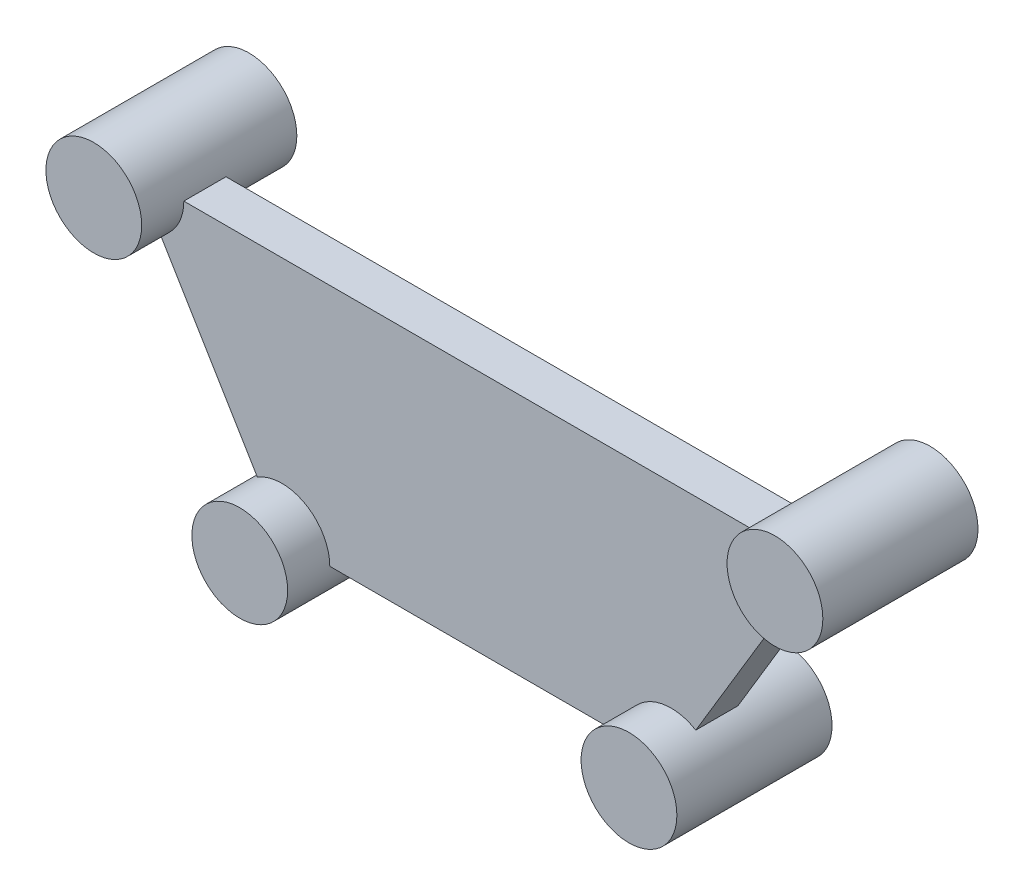
ISO-10303-21;
HEADER;
FILE_DESCRIPTION(('STEP AP214'),'2;1');
FILE_NAME('part.step','',(''),(''),'','','');
FILE_SCHEMA(('AUTOMOTIVE_DESIGN { 1 0 10303 214 1 1 1 1 }'));
ENDSEC;
DATA;
#1=APPLICATION_CONTEXT('core data for automotive mechanical design processes');
#2=APPLICATION_PROTOCOL_DEFINITION('international standard','automotive_design',2000,#1);
#3=PRODUCT_CONTEXT('',#1,'mechanical');
#4=PRODUCT('Part','Part','',(#3));
#5=PRODUCT_RELATED_PRODUCT_CATEGORY('part','',(#4));
#6=PRODUCT_DEFINITION_FORMATION('','',#4);
#7=PRODUCT_DEFINITION_CONTEXT('part definition',#1,'design');
#8=PRODUCT_DEFINITION('design','',#6,#7);
#9=PRODUCT_DEFINITION_SHAPE('','',#8);
#10=(LENGTH_UNIT() NAMED_UNIT(*) SI_UNIT(.MILLI.,.METRE.));
#11=(NAMED_UNIT(*) PLANE_ANGLE_UNIT() SI_UNIT($,.RADIAN.));
#12=(NAMED_UNIT(*) SI_UNIT($,.STERADIAN.) SOLID_ANGLE_UNIT());
#13=UNCERTAINTY_MEASURE_WITH_UNIT(LENGTH_MEASURE(1.E-05),#10,'distance_accuracy_value','');
#14=(GEOMETRIC_REPRESENTATION_CONTEXT(3) GLOBAL_UNCERTAINTY_ASSIGNED_CONTEXT((#13)) GLOBAL_UNIT_ASSIGNED_CONTEXT((#10,
#11,#12)) REPRESENTATION_CONTEXT('',''));
#15=CARTESIAN_POINT('',(0.,0.,0.));
#16=DIRECTION('',(0.,0.,1.));
#17=DIRECTION('',(1.,0.,0.));
#18=AXIS2_PLACEMENT_3D('',#15,#16,#17);
#19=CARTESIAN_POINT('',(101.6,-48.9376038944925,22.));
#20=DIRECTION('',(0.,-1.,0.));
#21=DIRECTION('',(0.,0.,-1.));
#22=AXIS2_PLACEMENT_3D('',#19,#20,#21);
#23=PLANE('',#22);
#24=DIRECTION('',(0.,0.,1.));
#25=VECTOR('',#24,1.);
#26=CARTESIAN_POINT('',(-76.6,-48.9376038944925,-37.));
#27=LINE('',#26,#25);
#28=CARTESIAN_POINT('',(-76.6,-48.9376038944925,0.));
#29=VERTEX_POINT('',#28);
#30=CARTESIAN_POINT('',(-76.6,-48.9376038944925,22.));
#31=VERTEX_POINT('',#30);
#32=EDGE_CURVE('E139',#29,#31,#27,.T.);
#33=ORIENTED_EDGE('',*,*,#32,.F.);
#34=DIRECTION('',(-1.,0.,0.));
#35=VECTOR('',#34,1.);
#36=CARTESIAN_POINT('',(101.6,-48.9376038944925,0.));
#37=LINE('',#36,#35);
#38=CARTESIAN_POINT('',(76.6,-48.9376038944925,0.));
#39=VERTEX_POINT('',#38);
#40=EDGE_CURVE('E111',#39,#29,#37,.T.);
#41=ORIENTED_EDGE('',*,*,#40,.F.);
#42=DIRECTION('',(0.,0.,1.));
#43=VECTOR('',#42,1.);
#44=CARTESIAN_POINT('',(76.5999999999999,-48.9376038944925,-37.));
#45=LINE('',#44,#43);
#46=CARTESIAN_POINT('',(76.6,-48.9376038944925,22.));
#47=VERTEX_POINT('',#46);
#48=EDGE_CURVE('E158',#47,#39,#45,.F.);
#49=ORIENTED_EDGE('',*,*,#48,.F.);
#50=DIRECTION('',(-1.,0.,0.));
#51=VECTOR('',#50,1.);
#52=CARTESIAN_POINT('',(101.6,-48.9376038944925,22.));
#53=LINE('',#52,#51);
#54=EDGE_CURVE('E185',#47,#31,#53,.T.);
#55=ORIENTED_EDGE('',*,*,#54,.T.);
#56=EDGE_LOOP('',(#33,#41,#49,#55));
#57=FACE_BOUND('',#56,.T.);
#58=ADVANCED_FACE('F37',(#57),#23,.T.);
#59=CARTESIAN_POINT('',(101.6,-48.9376038944925,22.));
#60=DIRECTION('',(-0.857492925712544,0.514495755427527,0.));
#61=DIRECTION('',(-0.514495755427527,-0.857492925712544,0.));
#62=AXIS2_PLACEMENT_3D('',#59,#60,#61);
#63=PLANE('',#62);
#64=DIRECTION('',(0.514495755427527,0.857492925712544,0.));
#65=VECTOR('',#64,1.);
#66=CARTESIAN_POINT('',(101.6,-48.9376038944925,22.));
#67=LINE('',#66,#65);
#68=CARTESIAN_POINT('',(114.462393885688,-27.5002807516789,22.));
#69=VERTEX_POINT('',#68);
#70=CARTESIAN_POINT('',(164.937606114312,56.6250729626939,22.));
#71=VERTEX_POINT('',#70);
#72=EDGE_CURVE('E195',#69,#71,#67,.T.);
#73=ORIENTED_EDGE('',*,*,#72,.F.);
#74=DIRECTION('',(0.,0.,1.));
#75=VECTOR('',#74,1.);
#76=CARTESIAN_POINT('',(114.462393885688,-27.5002807516789,-37.));
#77=LINE('',#76,#75);
#78=CARTESIAN_POINT('',(114.462393885688,-27.5002807516789,0.));
#79=VERTEX_POINT('',#78);
#80=EDGE_CURVE('E154',#69,#79,#77,.F.);
#81=ORIENTED_EDGE('',*,*,#80,.T.);
#82=DIRECTION('',(0.514495755427527,0.857492925712544,0.));
#83=VECTOR('',#82,1.);
#84=CARTESIAN_POINT('',(101.6,-48.9376038944925,0.));
#85=LINE('',#84,#83);
#86=CARTESIAN_POINT('',(164.937606114312,56.6250729626939,0.));
#87=VERTEX_POINT('',#86);
#88=EDGE_CURVE('E189',#79,#87,#85,.T.);
#89=ORIENTED_EDGE('',*,*,#88,.T.);
#90=DIRECTION('',(0.,0.,1.));
#91=VECTOR('',#90,1.);
#92=CARTESIAN_POINT('',(164.937606114312,56.6250729626939,-37.));
#93=LINE('',#92,#91);
#94=EDGE_CURVE('E177',#87,#71,#93,.T.);
#95=ORIENTED_EDGE('',*,*,#94,.T.);
#96=EDGE_LOOP('',(#73,#81,#89,#95));
#97=FACE_BOUND('',#96,.T.);
#98=ADVANCED_FACE('F226',(#97),#63,.F.);
#99=CARTESIAN_POINT('',(-177.8,78.0623961055075,22.));
#100=DIRECTION('',(0.,1.,0.));
#101=DIRECTION('',(0.,0.,1.));
#102=AXIS2_PLACEMENT_3D('',#99,#100,#101);
#103=PLANE('',#102);
#104=DIRECTION('',(0.,0.,1.));
#105=VECTOR('',#104,1.);
#106=CARTESIAN_POINT('',(-152.8,78.0623961055075,-37.));
#107=LINE('',#106,#105);
#108=CARTESIAN_POINT('',(-152.8,78.0623961055075,22.));
#109=VERTEX_POINT('',#108);
#110=CARTESIAN_POINT('',(-152.8,78.0623961055075,0.));
#111=VERTEX_POINT('',#110);
#112=EDGE_CURVE('E52',#109,#111,#107,.F.);
#113=ORIENTED_EDGE('',*,*,#112,.F.);
#114=DIRECTION('',(1.,0.,0.));
#115=VECTOR('',#114,1.);
#116=CARTESIAN_POINT('',(-177.8,78.0623961055075,22.));
#117=LINE('',#116,#115);
#118=CARTESIAN_POINT('',(152.8,78.0623961055075,22.));
#119=VERTEX_POINT('',#118);
#120=EDGE_CURVE('E192',#109,#119,#117,.T.);
#121=ORIENTED_EDGE('',*,*,#120,.T.);
#122=DIRECTION('',(0.,0.,1.));
#123=VECTOR('',#122,1.);
#124=CARTESIAN_POINT('',(152.8,78.0623961055075,-37.));
#125=LINE('',#124,#123);
#126=CARTESIAN_POINT('',(152.8,78.0623961055075,0.));
#127=VERTEX_POINT('',#126);
#128=EDGE_CURVE('E173',#127,#119,#125,.T.);
#129=ORIENTED_EDGE('',*,*,#128,.F.);
#130=DIRECTION('',(1.,0.,0.));
#131=VECTOR('',#130,1.);
#132=CARTESIAN_POINT('',(-177.8,78.0623961055075,0.));
#133=LINE('',#132,#131);
#134=EDGE_CURVE('E110',#111,#127,#133,.T.);
#135=ORIENTED_EDGE('',*,*,#134,.F.);
#136=EDGE_LOOP('',(#113,#121,#129,#135));
#137=FACE_BOUND('',#136,.T.);
#138=ADVANCED_FACE('F233',(#137),#103,.T.);
#139=CARTESIAN_POINT('',(-101.6,-48.9376038944925,22.));
#140=DIRECTION('',(-0.857492925712544,-0.514495755427527,0.));
#141=DIRECTION('',(0.514495755427527,-0.857492925712544,0.));
#142=AXIS2_PLACEMENT_3D('',#139,#140,#141);
#143=PLANE('',#142);
#144=DIRECTION('',(0.,0.,1.));
#145=VECTOR('',#144,1.);
#146=CARTESIAN_POINT('',(-164.937606114312,56.6250729626939,-37.));
#147=LINE('',#146,#145);
#148=CARTESIAN_POINT('',(-164.937606114312,56.6250729626939,0.));
#149=VERTEX_POINT('',#148);
#150=CARTESIAN_POINT('',(-164.937606114312,56.6250729626939,22.));
#151=VERTEX_POINT('',#150);
#152=EDGE_CURVE('E114',#149,#151,#147,.T.);
#153=ORIENTED_EDGE('',*,*,#152,.F.);
#154=DIRECTION('',(-0.514495755427527,0.857492925712544,0.));
#155=VECTOR('',#154,1.);
#156=CARTESIAN_POINT('',(-101.6,-48.9376038944925,0.));
#157=LINE('',#156,#155);
#158=CARTESIAN_POINT('',(-114.462393885688,-27.5002807516789,0.));
#159=VERTEX_POINT('',#158);
#160=EDGE_CURVE('E103',#159,#149,#157,.T.);
#161=ORIENTED_EDGE('',*,*,#160,.F.);
#162=DIRECTION('',(0.,0.,1.));
#163=VECTOR('',#162,1.);
#164=CARTESIAN_POINT('',(-114.462393885688,-27.5002807516789,-37.));
#165=LINE('',#164,#163);
#166=CARTESIAN_POINT('',(-114.462393885688,-27.5002807516789,22.));
#167=VERTEX_POINT('',#166);
#168=EDGE_CURVE('E136',#167,#159,#165,.F.);
#169=ORIENTED_EDGE('',*,*,#168,.F.);
#170=DIRECTION('',(-0.514495755427527,0.857492925712544,0.));
#171=VECTOR('',#170,1.);
#172=CARTESIAN_POINT('',(-101.6,-48.9376038944925,22.));
#173=LINE('',#172,#171);
#174=EDGE_CURVE('E116',#167,#151,#173,.T.);
#175=ORIENTED_EDGE('',*,*,#174,.T.);
#176=EDGE_LOOP('',(#153,#161,#169,#175));
#177=FACE_BOUND('',#176,.T.);
#178=ADVANCED_FACE('F115',(#177),#143,.T.);
#179=CARTESIAN_POINT('',(0.,0.,22.));
#180=DIRECTION('',(0.,0.,-1.));
#181=DIRECTION('',(-1.,0.,0.));
#182=AXIS2_PLACEMENT_3D('',#179,#180,#181);
#183=PLANE('',#182);
#184=ORIENTED_EDGE('',*,*,#120,.F.);
#185=CARTESIAN_POINT('',(-177.8,78.0623961055075,22.));
#186=DIRECTION('',(0.,0.,-1.));
#187=DIRECTION('',(-1.,0.,0.));
#188=AXIS2_PLACEMENT_3D('',#185,#186,#187);
#189=CIRCLE('',#188,25.);
#190=EDGE_CURVE('E59',#109,#151,#189,.T.);
#191=ORIENTED_EDGE('',*,*,#190,.T.);
#192=ORIENTED_EDGE('',*,*,#174,.F.);
#193=CARTESIAN_POINT('',(-101.6,-48.9376038944925,22.));
#194=DIRECTION('',(0.,0.,-1.));
#195=DIRECTION('',(-1.,0.,0.));
#196=AXIS2_PLACEMENT_3D('',#193,#194,#195);
#197=CIRCLE('',#196,25.);
#198=EDGE_CURVE('E143',#167,#31,#197,.T.);
#199=ORIENTED_EDGE('',*,*,#198,.T.);
#200=ORIENTED_EDGE('',*,*,#54,.F.);
#201=CARTESIAN_POINT('',(101.6,-48.9376038944925,22.));
#202=DIRECTION('',(0.,0.,-1.));
#203=DIRECTION('',(-1.,0.,0.));
#204=AXIS2_PLACEMENT_3D('',#201,#202,#203);
#205=CIRCLE('',#204,25.);
#206=EDGE_CURVE('E162',#47,#69,#205,.T.);
#207=ORIENTED_EDGE('',*,*,#206,.T.);
#208=ORIENTED_EDGE('',*,*,#72,.T.);
#209=CARTESIAN_POINT('',(177.8,78.0623961055075,22.));
#210=DIRECTION('',(0.,0.,-1.));
#211=DIRECTION('',(-1.,0.,0.));
#212=AXIS2_PLACEMENT_3D('',#209,#210,#211);
#213=CIRCLE('',#212,25.);
#214=EDGE_CURVE('E181',#71,#119,#213,.T.);
#215=ORIENTED_EDGE('',*,*,#214,.T.);
#216=EDGE_LOOP('',(#184,#191,#192,#199,#200,#207,#208,#215));
#217=FACE_BOUND('',#216,.T.);
#218=ADVANCED_FACE('F216',(#217),#183,.F.);
#219=CARTESIAN_POINT('',(0.,0.,0.));
#220=DIRECTION('',(0.,0.,-1.));
#221=DIRECTION('',(-1.,0.,0.));
#222=AXIS2_PLACEMENT_3D('',#219,#220,#221);
#223=PLANE('',#222);
#224=CARTESIAN_POINT('',(-177.8,78.0623961055075,0.));
#225=DIRECTION('',(0.,0.,-1.));
#226=DIRECTION('',(-1.,0.,0.));
#227=AXIS2_PLACEMENT_3D('',#224,#225,#226);
#228=CIRCLE('',#227,25.);
#229=EDGE_CURVE('E11',#111,#149,#228,.T.);
#230=ORIENTED_EDGE('',*,*,#229,.F.);
#231=ORIENTED_EDGE('',*,*,#134,.T.);
#232=CARTESIAN_POINT('',(177.8,78.0623961055075,0.));
#233=DIRECTION('',(0.,0.,-1.));
#234=DIRECTION('',(-1.,0.,0.));
#235=AXIS2_PLACEMENT_3D('',#232,#233,#234);
#236=CIRCLE('',#235,25.);
#237=EDGE_CURVE('E198',#87,#127,#236,.T.);
#238=ORIENTED_EDGE('',*,*,#237,.F.);
#239=ORIENTED_EDGE('',*,*,#88,.F.);
#240=CARTESIAN_POINT('',(101.6,-48.9376038944925,0.));
#241=DIRECTION('',(0.,0.,-1.));
#242=DIRECTION('',(-1.,0.,0.));
#243=AXIS2_PLACEMENT_3D('',#240,#241,#242);
#244=CIRCLE('',#243,25.);
#245=EDGE_CURVE('E208',#39,#79,#244,.T.);
#246=ORIENTED_EDGE('',*,*,#245,.F.);
#247=ORIENTED_EDGE('',*,*,#40,.T.);
#248=CARTESIAN_POINT('',(-101.6,-48.9376038944925,0.));
#249=DIRECTION('',(0.,0.,-1.));
#250=DIRECTION('',(-1.,0.,0.));
#251=AXIS2_PLACEMENT_3D('',#248,#249,#250);
#252=CIRCLE('',#251,25.);
#253=EDGE_CURVE('E45',#159,#29,#252,.T.);
#254=ORIENTED_EDGE('',*,*,#253,.F.);
#255=ORIENTED_EDGE('',*,*,#160,.T.);
#256=EDGE_LOOP('',(#230,#231,#238,#239,#246,#247,#254,#255));
#257=FACE_BOUND('',#256,.T.);
#258=ADVANCED_FACE('F105',(#257),#223,.T.);
#259=CARTESIAN_POINT('',(177.8,78.0623961055075,-37.));
#260=DIRECTION('',(0.,0.,1.));
#261=DIRECTION('',(1.,0.,0.));
#262=AXIS2_PLACEMENT_3D('',#259,#260,#261);
#263=CYLINDRICAL_SURFACE('',#262,25.);
#264=CARTESIAN_POINT('',(177.8,78.0623961055075,44.));
#265=DIRECTION('',(0.,0.,1.));
#266=DIRECTION('',(1.,0.,0.));
#267=AXIS2_PLACEMENT_3D('',#264,#265,#266);
#268=CIRCLE('',#267,25.);
#269=CARTESIAN_POINT('',(202.8,78.0623961055075,44.));
#270=VERTEX_POINT('',#269);
#271=EDGE_CURVE('E165',#270,#270,#268,.T.);
#272=ORIENTED_EDGE('',*,*,#271,.F.);
#273=EDGE_LOOP('',(#272));
#274=FACE_BOUND('',#273,.T.);
#275=CARTESIAN_POINT('',(177.8,78.0623961055075,-37.));
#276=DIRECTION('',(0.,0.,1.));
#277=DIRECTION('',(1.,0.,0.));
#278=AXIS2_PLACEMENT_3D('',#275,#276,#277);
#279=CIRCLE('',#278,25.);
#280=CARTESIAN_POINT('',(202.8,78.0623961055075,-37.));
#281=VERTEX_POINT('',#280);
#282=EDGE_CURVE('E169',#281,#281,#279,.T.);
#283=ORIENTED_EDGE('',*,*,#282,.T.);
#284=EDGE_LOOP('',(#283));
#285=FACE_BOUND('',#284,.T.);
#286=ORIENTED_EDGE('',*,*,#214,.F.);
#287=ORIENTED_EDGE('',*,*,#94,.F.);
#288=ORIENTED_EDGE('',*,*,#237,.T.);
#289=ORIENTED_EDGE('',*,*,#128,.T.);
#290=EDGE_LOOP('',(#286,#287,#288,#289));
#291=FACE_BOUND('',#290,.T.);
#292=ADVANCED_FACE('F231',(#274,#285,#291),#263,.T.);
#293=CARTESIAN_POINT('',(177.8,78.0623961055075,-37.));
#294=DIRECTION('',(0.,0.,1.));
#295=DIRECTION('',(1.,0.,0.));
#296=AXIS2_PLACEMENT_3D('',#293,#294,#295);
#297=PLANE('',#296);
#298=ORIENTED_EDGE('',*,*,#282,.F.);
#299=EDGE_LOOP('',(#298));
#300=FACE_BOUND('',#299,.T.);
#301=ADVANCED_FACE('F283',(#300),#297,.F.);
#302=CARTESIAN_POINT('',(177.8,78.0623961055075,44.));
#303=DIRECTION('',(0.,0.,1.));
#304=DIRECTION('',(1.,0.,0.));
#305=AXIS2_PLACEMENT_3D('',#302,#303,#304);
#306=PLANE('',#305);
#307=ORIENTED_EDGE('',*,*,#271,.T.);
#308=EDGE_LOOP('',(#307));
#309=FACE_BOUND('',#308,.T.);
#310=ADVANCED_FACE('F293',(#309),#306,.T.);
#311=CARTESIAN_POINT('',(101.6,-48.9376038944925,-37.));
#312=DIRECTION('',(0.,0.,1.));
#313=DIRECTION('',(1.,0.,0.));
#314=AXIS2_PLACEMENT_3D('',#311,#312,#313);
#315=CYLINDRICAL_SURFACE('',#314,25.);
#316=CARTESIAN_POINT('',(101.6,-48.9376038944925,44.));
#317=DIRECTION('',(0.,0.,1.));
#318=DIRECTION('',(1.,0.,0.));
#319=AXIS2_PLACEMENT_3D('',#316,#317,#318);
#320=CIRCLE('',#319,25.);
#321=CARTESIAN_POINT('',(126.6,-48.9376038944925,44.));
#322=VERTEX_POINT('',#321);
#323=EDGE_CURVE('E150',#322,#322,#320,.T.);
#324=ORIENTED_EDGE('',*,*,#323,.F.);
#325=EDGE_LOOP('',(#324));
#326=FACE_BOUND('',#325,.T.);
#327=CARTESIAN_POINT('',(101.6,-48.9376038944925,-37.));
#328=DIRECTION('',(0.,0.,1.));
#329=DIRECTION('',(1.,0.,0.));
#330=AXIS2_PLACEMENT_3D('',#327,#328,#329);
#331=CIRCLE('',#330,25.);
#332=CARTESIAN_POINT('',(126.6,-48.9376038944925,-37.));
#333=VERTEX_POINT('',#332);
#334=EDGE_CURVE('E146',#333,#333,#331,.T.);
#335=ORIENTED_EDGE('',*,*,#334,.T.);
#336=EDGE_LOOP('',(#335));
#337=FACE_BOUND('',#336,.T.);
#338=ORIENTED_EDGE('',*,*,#206,.F.);
#339=ORIENTED_EDGE('',*,*,#48,.T.);
#340=ORIENTED_EDGE('',*,*,#245,.T.);
#341=ORIENTED_EDGE('',*,*,#80,.F.);
#342=EDGE_LOOP('',(#338,#339,#340,#341));
#343=FACE_BOUND('',#342,.T.);
#344=ADVANCED_FACE('F222',(#326,#337,#343),#315,.T.);
#345=CARTESIAN_POINT('',(101.6,-48.9376038944925,-37.));
#346=DIRECTION('',(0.,0.,1.));
#347=DIRECTION('',(1.,0.,0.));
#348=AXIS2_PLACEMENT_3D('',#345,#346,#347);
#349=PLANE('',#348);
#350=ORIENTED_EDGE('',*,*,#334,.F.);
#351=EDGE_LOOP('',(#350));
#352=FACE_BOUND('',#351,.T.);
#353=ADVANCED_FACE('F312',(#352),#349,.F.);
#354=CARTESIAN_POINT('',(101.6,-48.9376038944925,44.));
#355=DIRECTION('',(0.,0.,1.));
#356=DIRECTION('',(1.,0.,0.));
#357=AXIS2_PLACEMENT_3D('',#354,#355,#356);
#358=PLANE('',#357);
#359=ORIENTED_EDGE('',*,*,#323,.T.);
#360=EDGE_LOOP('',(#359));
#361=FACE_BOUND('',#360,.T.);
#362=ADVANCED_FACE('F322',(#361),#358,.T.);
#363=CARTESIAN_POINT('',(-101.6,-48.9376038944925,-37.));
#364=DIRECTION('',(0.,0.,1.));
#365=DIRECTION('',(1.,0.,0.));
#366=AXIS2_PLACEMENT_3D('',#363,#364,#365);
#367=CYLINDRICAL_SURFACE('',#366,25.);
#368=CARTESIAN_POINT('',(-101.6,-48.9376038944925,44.));
#369=DIRECTION('',(0.,0.,1.));
#370=DIRECTION('',(1.,0.,0.));
#371=AXIS2_PLACEMENT_3D('',#368,#369,#370);
#372=CIRCLE('',#371,25.);
#373=CARTESIAN_POINT('',(-76.6,-48.9376038944925,44.));
#374=VERTEX_POINT('',#373);
#375=EDGE_CURVE('E132',#374,#374,#372,.T.);
#376=ORIENTED_EDGE('',*,*,#375,.F.);
#377=EDGE_LOOP('',(#376));
#378=FACE_BOUND('',#377,.T.);
#379=CARTESIAN_POINT('',(-101.6,-48.9376038944925,-37.));
#380=DIRECTION('',(0.,0.,1.));
#381=DIRECTION('',(1.,0.,0.));
#382=AXIS2_PLACEMENT_3D('',#379,#380,#381);
#383=CIRCLE('',#382,25.);
#384=CARTESIAN_POINT('',(-76.6,-48.9376038944925,-37.));
#385=VERTEX_POINT('',#384);
#386=EDGE_CURVE('E125',#385,#385,#383,.T.);
#387=ORIENTED_EDGE('',*,*,#386,.T.);
#388=EDGE_LOOP('',(#387));
#389=FACE_BOUND('',#388,.T.);
#390=ORIENTED_EDGE('',*,*,#198,.F.);
#391=ORIENTED_EDGE('',*,*,#168,.T.);
#392=ORIENTED_EDGE('',*,*,#253,.T.);
#393=ORIENTED_EDGE('',*,*,#32,.T.);
#394=EDGE_LOOP('',(#390,#391,#392,#393));
#395=FACE_BOUND('',#394,.T.);
#396=ADVANCED_FACE('F214',(#378,#389,#395),#367,.T.);
#397=CARTESIAN_POINT('',(-101.6,-48.9376038944925,-37.));
#398=DIRECTION('',(0.,0.,1.));
#399=DIRECTION('',(1.,0.,0.));
#400=AXIS2_PLACEMENT_3D('',#397,#398,#399);
#401=PLANE('',#400);
#402=ORIENTED_EDGE('',*,*,#386,.F.);
#403=EDGE_LOOP('',(#402));
#404=FACE_BOUND('',#403,.T.);
#405=ADVANCED_FACE('F341',(#404),#401,.F.);
#406=CARTESIAN_POINT('',(-101.6,-48.9376038944925,44.));
#407=DIRECTION('',(0.,0.,1.));
#408=DIRECTION('',(1.,0.,0.));
#409=AXIS2_PLACEMENT_3D('',#406,#407,#408);
#410=PLANE('',#409);
#411=ORIENTED_EDGE('',*,*,#375,.T.);
#412=EDGE_LOOP('',(#411));
#413=FACE_BOUND('',#412,.T.);
#414=ADVANCED_FACE('F351',(#413),#410,.T.);
#415=CARTESIAN_POINT('',(-177.8,78.0623961055075,-37.));
#416=DIRECTION('',(0.,0.,1.));
#417=DIRECTION('',(1.,0.,0.));
#418=AXIS2_PLACEMENT_3D('',#415,#416,#417);
#419=CYLINDRICAL_SURFACE('',#418,25.);
#420=CARTESIAN_POINT('',(-177.8,78.0623961055075,44.));
#421=DIRECTION('',(0.,0.,1.));
#422=DIRECTION('',(1.,0.,0.));
#423=AXIS2_PLACEMENT_3D('',#420,#421,#422);
#424=CIRCLE('',#423,25.);
#425=CARTESIAN_POINT('',(-152.8,78.0623961055075,44.));
#426=VERTEX_POINT('',#425);
#427=EDGE_CURVE('E119',#426,#426,#424,.T.);
#428=ORIENTED_EDGE('',*,*,#427,.F.);
#429=EDGE_LOOP('',(#428));
#430=FACE_BOUND('',#429,.T.);
#431=CARTESIAN_POINT('',(-177.8,78.0623961055075,-37.));
#432=DIRECTION('',(0.,0.,1.));
#433=DIRECTION('',(1.,0.,0.));
#434=AXIS2_PLACEMENT_3D('',#431,#432,#433);
#435=CIRCLE('',#434,25.);
#436=CARTESIAN_POINT('',(-152.8,78.0623961055075,-37.));
#437=VERTEX_POINT('',#436);
#438=EDGE_CURVE('E397',#437,#437,#435,.T.);
#439=ORIENTED_EDGE('',*,*,#438,.T.);
#440=EDGE_LOOP('',(#439));
#441=FACE_BOUND('',#440,.T.);
#442=ORIENTED_EDGE('',*,*,#190,.F.);
#443=ORIENTED_EDGE('',*,*,#112,.T.);
#444=ORIENTED_EDGE('',*,*,#229,.T.);
#445=ORIENTED_EDGE('',*,*,#152,.T.);
#446=EDGE_LOOP('',(#442,#443,#444,#445));
#447=FACE_BOUND('',#446,.T.);
#448=ADVANCED_FACE('F121',(#430,#441,#447),#419,.T.);
#449=CARTESIAN_POINT('',(-177.8,78.0623961055075,-37.));
#450=DIRECTION('',(0.,0.,1.));
#451=DIRECTION('',(1.,0.,0.));
#452=AXIS2_PLACEMENT_3D('',#449,#450,#451);
#453=PLANE('',#452);
#454=ORIENTED_EDGE('',*,*,#438,.F.);
#455=EDGE_LOOP('',(#454));
#456=FACE_BOUND('',#455,.T.);
#457=ADVANCED_FACE('F370',(#456),#453,.F.);
#458=CARTESIAN_POINT('',(-177.8,78.0623961055075,44.));
#459=DIRECTION('',(0.,0.,1.));
#460=DIRECTION('',(1.,0.,0.));
#461=AXIS2_PLACEMENT_3D('',#458,#459,#460);
#462=PLANE('',#461);
#463=ORIENTED_EDGE('',*,*,#427,.T.);
#464=EDGE_LOOP('',(#463));
#465=FACE_BOUND('',#464,.T.);
#466=ADVANCED_FACE('F380',(#465),#462,.T.);
#467=CLOSED_SHELL('',(#58,#98,#138,#178,#218,#258,#292,#301,#310,#344,#353,#362,#396,#405,#414,
#448,#457,#466));
#468=MANIFOLD_SOLID_BREP('B2',#467);
#469=ADVANCED_BREP_SHAPE_REPRESENTATION('',(#18,#468),#14);
#470=SHAPE_DEFINITION_REPRESENTATION(#9,#469);
ENDSEC;
END-ISO-10303-21;
